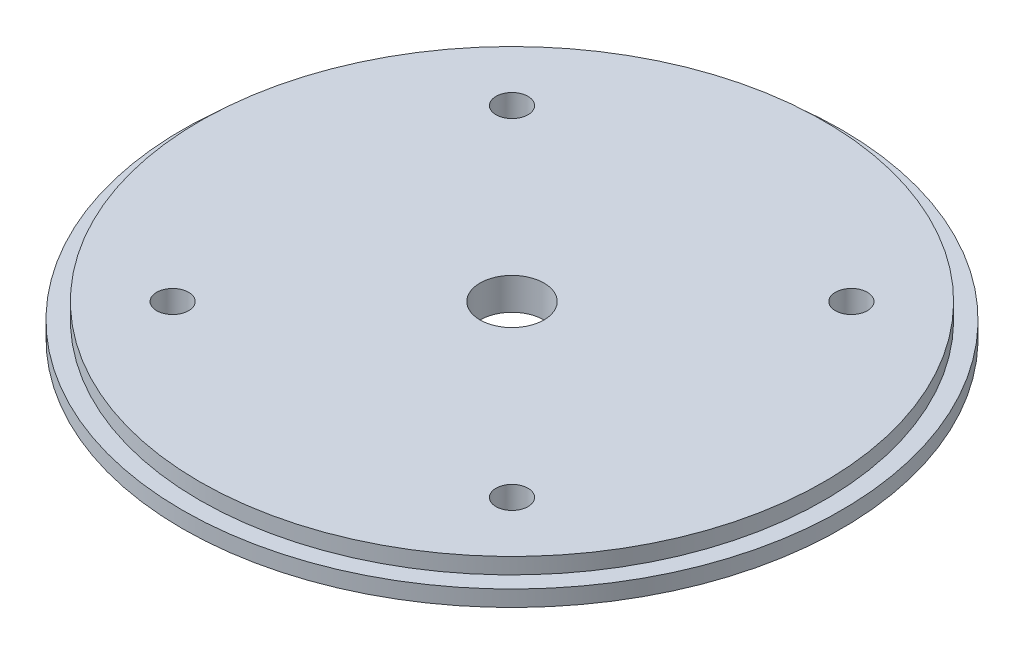
ISO-10303-21;
HEADER;
FILE_DESCRIPTION(('STEP AP214'),'2;1');
FILE_NAME('part.step','',(''),(''),'','','');
FILE_SCHEMA(('AUTOMOTIVE_DESIGN { 1 0 10303 214 1 1 1 1 }'));
ENDSEC;
DATA;
#1=APPLICATION_CONTEXT('core data for automotive mechanical design processes');
#2=APPLICATION_PROTOCOL_DEFINITION('international standard','automotive_design',2000,#1);
#3=PRODUCT_CONTEXT('',#1,'mechanical');
#4=PRODUCT('Part','Part','',(#3));
#5=PRODUCT_RELATED_PRODUCT_CATEGORY('part','',(#4));
#6=PRODUCT_DEFINITION_FORMATION('','',#4);
#7=PRODUCT_DEFINITION_CONTEXT('part definition',#1,'design');
#8=PRODUCT_DEFINITION('design','',#6,#7);
#9=PRODUCT_DEFINITION_SHAPE('','',#8);
#10=(LENGTH_UNIT() NAMED_UNIT(*) SI_UNIT(.MILLI.,.METRE.));
#11=(NAMED_UNIT(*) PLANE_ANGLE_UNIT() SI_UNIT($,.RADIAN.));
#12=(NAMED_UNIT(*) SI_UNIT($,.STERADIAN.) SOLID_ANGLE_UNIT());
#13=UNCERTAINTY_MEASURE_WITH_UNIT(LENGTH_MEASURE(1.E-05),#10,'distance_accuracy_value','');
#14=(GEOMETRIC_REPRESENTATION_CONTEXT(3) GLOBAL_UNCERTAINTY_ASSIGNED_CONTEXT((#13)) GLOBAL_UNIT_ASSIGNED_CONTEXT((#10,
#11,#12)) REPRESENTATION_CONTEXT('',''));
#15=CARTESIAN_POINT('',(0.,0.,0.));
#16=DIRECTION('',(0.,0.,1.));
#17=DIRECTION('',(1.,0.,0.));
#18=AXIS2_PLACEMENT_3D('',#15,#16,#17);
#19=CARTESIAN_POINT('',(-33.6759604540092,6.35,-33.6759604540095));
#20=DIRECTION('',(0.,1.,0.));
#21=DIRECTION('',(0.,0.,1.));
#22=AXIS2_PLACEMENT_3D('',#19,#20,#21);
#23=CYLINDRICAL_SURFACE('',#22,3.175);
#24=CARTESIAN_POINT('',(-33.6759604540092,6.35,-33.6759604540095));
#25=DIRECTION('',(0.,1.,0.));
#26=DIRECTION('',(0.,0.,1.));
#27=AXIS2_PLACEMENT_3D('',#24,#25,#26);
#28=CIRCLE('',#27,3.175);
#29=CARTESIAN_POINT('',(-33.6759604540092,6.35,-30.5009604540095));
#30=VERTEX_POINT('',#29);
#31=EDGE_CURVE('E88',#30,#30,#28,.T.);
#32=ORIENTED_EDGE('',*,*,#31,.T.);
#33=EDGE_LOOP('',(#32));
#34=FACE_BOUND('',#33,.T.);
#35=CARTESIAN_POINT('',(-33.6759604540092,1.5875,-33.6759604540095));
#36=DIRECTION('',(0.,-1.,0.));
#37=DIRECTION('',(0.,0.,-1.));
#38=AXIS2_PLACEMENT_3D('',#35,#36,#37);
#39=CIRCLE('',#38,3.175);
#40=CARTESIAN_POINT('',(-33.6759604540092,1.5875,-36.8509604540095));
#41=VERTEX_POINT('',#40);
#42=EDGE_CURVE('E41',#41,#41,#39,.F.);
#43=ORIENTED_EDGE('',*,*,#42,.F.);
#44=EDGE_LOOP('',(#43));
#45=FACE_BOUND('',#44,.T.);
#46=ADVANCED_FACE('F37',(#34,#45),#23,.F.);
#47=CARTESIAN_POINT('',(33.6759604540091,6.35,33.6759604540095));
#48=DIRECTION('',(0.,1.,0.));
#49=DIRECTION('',(0.,0.,1.));
#50=AXIS2_PLACEMENT_3D('',#47,#48,#49);
#51=CYLINDRICAL_SURFACE('',#50,3.175);
#52=CARTESIAN_POINT('',(33.6759604540091,6.35,33.6759604540095));
#53=DIRECTION('',(0.,1.,0.));
#54=DIRECTION('',(0.,0.,1.));
#55=AXIS2_PLACEMENT_3D('',#52,#53,#54);
#56=CIRCLE('',#55,3.175);
#57=CARTESIAN_POINT('',(33.6759604540091,6.35,36.8509604540095));
#58=VERTEX_POINT('',#57);
#59=EDGE_CURVE('E85',#58,#58,#56,.T.);
#60=ORIENTED_EDGE('',*,*,#59,.T.);
#61=EDGE_LOOP('',(#60));
#62=FACE_BOUND('',#61,.T.);
#63=CARTESIAN_POINT('',(33.6759604540091,1.5875,33.6759604540095));
#64=DIRECTION('',(0.,-1.,0.));
#65=DIRECTION('',(0.,0.,-1.));
#66=AXIS2_PLACEMENT_3D('',#63,#64,#65);
#67=CIRCLE('',#66,3.175);
#68=CARTESIAN_POINT('',(33.6759604540091,1.5875,30.5009604540095));
#69=VERTEX_POINT('',#68);
#70=EDGE_CURVE('E60',#69,#69,#67,.F.);
#71=ORIENTED_EDGE('',*,*,#70,.F.);
#72=EDGE_LOOP('',(#71));
#73=FACE_BOUND('',#72,.T.);
#74=ADVANCED_FACE('F115',(#62,#73),#51,.F.);
#75=CARTESIAN_POINT('',(33.6759604540095,6.35,-33.6759604540092));
#76=DIRECTION('',(0.,1.,0.));
#77=DIRECTION('',(0.,0.,1.));
#78=AXIS2_PLACEMENT_3D('',#75,#76,#77);
#79=CYLINDRICAL_SURFACE('',#78,3.175);
#80=CARTESIAN_POINT('',(33.6759604540095,6.35,-33.6759604540092));
#81=DIRECTION('',(0.,1.,0.));
#82=DIRECTION('',(0.,0.,1.));
#83=AXIS2_PLACEMENT_3D('',#80,#81,#82);
#84=CIRCLE('',#83,3.175);
#85=CARTESIAN_POINT('',(33.6759604540095,6.35,-30.5009604540092));
#86=VERTEX_POINT('',#85);
#87=EDGE_CURVE('E82',#86,#86,#84,.T.);
#88=ORIENTED_EDGE('',*,*,#87,.T.);
#89=EDGE_LOOP('',(#88));
#90=FACE_BOUND('',#89,.T.);
#91=CARTESIAN_POINT('',(33.6759604540095,1.5875,-33.6759604540092));
#92=DIRECTION('',(0.,-1.,0.));
#93=DIRECTION('',(0.,0.,-1.));
#94=AXIS2_PLACEMENT_3D('',#91,#92,#93);
#95=CIRCLE('',#94,3.175);
#96=CARTESIAN_POINT('',(33.6759604540095,1.5875,-36.8509604540092));
#97=VERTEX_POINT('',#96);
#98=EDGE_CURVE('E57',#97,#97,#95,.F.);
#99=ORIENTED_EDGE('',*,*,#98,.F.);
#100=EDGE_LOOP('',(#99));
#101=FACE_BOUND('',#100,.T.);
#102=ADVANCED_FACE('F121',(#90,#101),#79,.F.);
#103=CARTESIAN_POINT('',(-33.6759604540095,6.35,33.6759604540092));
#104=DIRECTION('',(0.,1.,0.));
#105=DIRECTION('',(0.,0.,1.));
#106=AXIS2_PLACEMENT_3D('',#103,#104,#105);
#107=CYLINDRICAL_SURFACE('',#106,3.175);
#108=CARTESIAN_POINT('',(-33.6759604540095,6.35,33.6759604540092));
#109=DIRECTION('',(0.,1.,0.));
#110=DIRECTION('',(0.,0.,1.));
#111=AXIS2_PLACEMENT_3D('',#108,#109,#110);
#112=CIRCLE('',#111,3.175);
#113=CARTESIAN_POINT('',(-33.6759604540095,6.35,36.8509604540092));
#114=VERTEX_POINT('',#113);
#115=EDGE_CURVE('E74',#114,#114,#112,.T.);
#116=ORIENTED_EDGE('',*,*,#115,.T.);
#117=EDGE_LOOP('',(#116));
#118=FACE_BOUND('',#117,.T.);
#119=CARTESIAN_POINT('',(-33.6759604540095,1.5875,33.6759604540092));
#120=DIRECTION('',(0.,-1.,0.));
#121=DIRECTION('',(0.,0.,-1.));
#122=AXIS2_PLACEMENT_3D('',#119,#120,#121);
#123=CIRCLE('',#122,3.175);
#124=CARTESIAN_POINT('',(-33.6759604540095,1.5875,30.5009604540092));
#125=VERTEX_POINT('',#124);
#126=EDGE_CURVE('E54',#125,#125,#123,.F.);
#127=ORIENTED_EDGE('',*,*,#126,.F.);
#128=EDGE_LOOP('',(#127));
#129=FACE_BOUND('',#128,.T.);
#130=ADVANCED_FACE('F128',(#118,#129),#107,.F.);
#131=CARTESIAN_POINT('',(0.,6.35,0.));
#132=DIRECTION('',(0.,-1.,0.));
#133=DIRECTION('',(0.,0.,-1.));
#134=AXIS2_PLACEMENT_3D('',#131,#132,#133);
#135=CYLINDRICAL_SURFACE('',#134,65.405);
#136=CARTESIAN_POINT('',(0.,0.,0.));
#137=DIRECTION('',(0.,1.,0.));
#138=DIRECTION('',(0.,0.,1.));
#139=AXIS2_PLACEMENT_3D('',#136,#137,#138);
#140=CIRCLE('',#139,65.405);
#141=CARTESIAN_POINT('',(0.,0.,65.405));
#142=VERTEX_POINT('',#141);
#143=EDGE_CURVE('E10',#142,#142,#140,.T.);
#144=ORIENTED_EDGE('',*,*,#143,.T.);
#145=EDGE_LOOP('',(#144));
#146=FACE_BOUND('',#145,.T.);
#147=CARTESIAN_POINT('',(0.,3.175,0.));
#148=DIRECTION('',(0.,1.,0.));
#149=DIRECTION('',(0.,0.,1.));
#150=AXIS2_PLACEMENT_3D('',#147,#148,#149);
#151=CIRCLE('',#150,65.405);
#152=CARTESIAN_POINT('',(0.,3.175,65.405));
#153=VERTEX_POINT('',#152);
#154=EDGE_CURVE('E45',#153,#153,#151,.T.);
#155=ORIENTED_EDGE('',*,*,#154,.F.);
#156=EDGE_LOOP('',(#155));
#157=FACE_BOUND('',#156,.T.);
#158=ADVANCED_FACE('F39',(#146,#157),#135,.T.);
#159=CARTESIAN_POINT('',(0.,0.,0.));
#160=DIRECTION('',(0.,1.,0.));
#161=DIRECTION('',(0.,0.,1.));
#162=AXIS2_PLACEMENT_3D('',#159,#160,#161);
#163=PLANE('',#162);
#164=CARTESIAN_POINT('',(-33.6759604540092,0.,-33.6759604540095));
#165=DIRECTION('',(0.,-1.,0.));
#166=DIRECTION('',(0.,0.,-1.));
#167=AXIS2_PLACEMENT_3D('',#164,#165,#166);
#168=CIRCLE('',#167,6.0325);
#169=CARTESIAN_POINT('',(-33.6759604540092,0.,-39.7084604540095));
#170=VERTEX_POINT('',#169);
#171=EDGE_CURVE('E186',#170,#170,#168,.T.);
#172=ORIENTED_EDGE('',*,*,#171,.F.);
#173=EDGE_LOOP('',(#172));
#174=FACE_BOUND('',#173,.T.);
#175=CARTESIAN_POINT('',(33.6759604540095,0.,-33.6759604540092));
#176=DIRECTION('',(0.,-1.,0.));
#177=DIRECTION('',(0.,0.,-1.));
#178=AXIS2_PLACEMENT_3D('',#175,#176,#177);
#179=CIRCLE('',#178,6.0325);
#180=CARTESIAN_POINT('',(33.6759604540095,0.,-39.7084604540092));
#181=VERTEX_POINT('',#180);
#182=EDGE_CURVE('E178',#181,#181,#179,.T.);
#183=ORIENTED_EDGE('',*,*,#182,.F.);
#184=EDGE_LOOP('',(#183));
#185=FACE_BOUND('',#184,.T.);
#186=CARTESIAN_POINT('',(33.6759604540091,0.,33.6759604540095));
#187=DIRECTION('',(0.,-1.,0.));
#188=DIRECTION('',(0.,0.,-1.));
#189=AXIS2_PLACEMENT_3D('',#186,#187,#188);
#190=CIRCLE('',#189,6.03249999999999);
#191=CARTESIAN_POINT('',(33.6759604540091,0.,27.6434604540095));
#192=VERTEX_POINT('',#191);
#193=EDGE_CURVE('E174',#192,#192,#190,.T.);
#194=ORIENTED_EDGE('',*,*,#193,.F.);
#195=EDGE_LOOP('',(#194));
#196=FACE_BOUND('',#195,.T.);
#197=CARTESIAN_POINT('',(-33.6759604540095,0.,33.6759604540092));
#198=DIRECTION('',(0.,-1.,0.));
#199=DIRECTION('',(0.,0.,-1.));
#200=AXIS2_PLACEMENT_3D('',#197,#198,#199);
#201=CIRCLE('',#200,6.0325);
#202=CARTESIAN_POINT('',(-33.6759604540095,0.,27.6434604540092));
#203=VERTEX_POINT('',#202);
#204=EDGE_CURVE('E77',#203,#203,#201,.T.);
#205=ORIENTED_EDGE('',*,*,#204,.F.);
#206=EDGE_LOOP('',(#205));
#207=FACE_BOUND('',#206,.T.);
#208=CARTESIAN_POINT('',(0.,0.,0.));
#209=DIRECTION('',(0.,1.,0.));
#210=DIRECTION('',(0.,0.,1.));
#211=AXIS2_PLACEMENT_3D('',#208,#209,#210);
#212=CIRCLE('',#211,6.35);
#213=CARTESIAN_POINT('',(0.,0.,6.35));
#214=VERTEX_POINT('',#213);
#215=EDGE_CURVE('E69',#214,#214,#212,.T.);
#216=ORIENTED_EDGE('',*,*,#215,.T.);
#217=EDGE_LOOP('',(#216));
#218=FACE_BOUND('',#217,.T.);
#219=ORIENTED_EDGE('',*,*,#143,.F.);
#220=EDGE_LOOP('',(#219));
#221=FACE_BOUND('',#220,.T.);
#222=ADVANCED_FACE('F110',(#174,#185,#196,#207,#218,#221),#163,.F.);
#223=CARTESIAN_POINT('',(0.,3.175,0.));
#224=DIRECTION('',(0.,1.,0.));
#225=DIRECTION('',(0.,0.,1.));
#226=AXIS2_PLACEMENT_3D('',#223,#224,#225);
#227=PLANE('',#226);
#228=CARTESIAN_POINT('',(0.,3.175,0.));
#229=DIRECTION('',(0.,1.,0.));
#230=DIRECTION('',(0.,0.,1.));
#231=AXIS2_PLACEMENT_3D('',#228,#229,#230);
#232=CIRCLE('',#231,61.976);
#233=CARTESIAN_POINT('',(0.,3.175,61.976));
#234=VERTEX_POINT('',#233);
#235=EDGE_CURVE('E50',#234,#234,#232,.T.);
#236=ORIENTED_EDGE('',*,*,#235,.F.);
#237=EDGE_LOOP('',(#236));
#238=FACE_BOUND('',#237,.T.);
#239=ORIENTED_EDGE('',*,*,#154,.T.);
#240=EDGE_LOOP('',(#239));
#241=FACE_BOUND('',#240,.T.);
#242=ADVANCED_FACE('F100',(#238,#241),#227,.T.);
#243=CARTESIAN_POINT('',(0.,3.175,0.));
#244=DIRECTION('',(0.,1.,0.));
#245=DIRECTION('',(0.,0.,1.));
#246=AXIS2_PLACEMENT_3D('',#243,#244,#245);
#247=CYLINDRICAL_SURFACE('',#246,61.976);
#248=ORIENTED_EDGE('',*,*,#235,.T.);
#249=EDGE_LOOP('',(#248));
#250=FACE_BOUND('',#249,.T.);
#251=CARTESIAN_POINT('',(0.,6.35,0.));
#252=DIRECTION('',(0.,1.,0.));
#253=DIRECTION('',(0.,0.,1.));
#254=AXIS2_PLACEMENT_3D('',#251,#252,#253);
#255=CIRCLE('',#254,61.976);
#256=CARTESIAN_POINT('',(0.,6.35,61.976));
#257=VERTEX_POINT('',#256);
#258=EDGE_CURVE('E91',#257,#257,#255,.T.);
#259=ORIENTED_EDGE('',*,*,#258,.F.);
#260=EDGE_LOOP('',(#259));
#261=FACE_BOUND('',#260,.T.);
#262=ADVANCED_FACE('F98',(#250,#261),#247,.T.);
#263=CARTESIAN_POINT('',(0.,6.35,0.));
#264=DIRECTION('',(0.,1.,0.));
#265=DIRECTION('',(0.,0.,1.));
#266=AXIS2_PLACEMENT_3D('',#263,#264,#265);
#267=PLANE('',#266);
#268=CARTESIAN_POINT('',(0.,6.35,0.));
#269=DIRECTION('',(0.,1.,0.));
#270=DIRECTION('',(0.,0.,1.));
#271=AXIS2_PLACEMENT_3D('',#268,#269,#270);
#272=CIRCLE('',#271,6.35);
#273=CARTESIAN_POINT('',(0.,6.35,6.35));
#274=VERTEX_POINT('',#273);
#275=EDGE_CURVE('E65',#274,#274,#272,.T.);
#276=ORIENTED_EDGE('',*,*,#275,.F.);
#277=EDGE_LOOP('',(#276));
#278=FACE_BOUND('',#277,.T.);
#279=ORIENTED_EDGE('',*,*,#115,.F.);
#280=EDGE_LOOP('',(#279));
#281=FACE_BOUND('',#280,.T.);
#282=ORIENTED_EDGE('',*,*,#87,.F.);
#283=EDGE_LOOP('',(#282));
#284=FACE_BOUND('',#283,.T.);
#285=ORIENTED_EDGE('',*,*,#59,.F.);
#286=EDGE_LOOP('',(#285));
#287=FACE_BOUND('',#286,.T.);
#288=ORIENTED_EDGE('',*,*,#31,.F.);
#289=EDGE_LOOP('',(#288));
#290=FACE_BOUND('',#289,.T.);
#291=ORIENTED_EDGE('',*,*,#258,.T.);
#292=EDGE_LOOP('',(#291));
#293=FACE_BOUND('',#292,.T.);
#294=ADVANCED_FACE('F96',(#278,#281,#284,#287,#290,#293),#267,.T.);
#295=CARTESIAN_POINT('',(0.,6.35,0.));
#296=DIRECTION('',(0.,1.,0.));
#297=DIRECTION('',(0.,0.,1.));
#298=AXIS2_PLACEMENT_3D('',#295,#296,#297);
#299=CYLINDRICAL_SURFACE('',#298,6.35);
#300=ORIENTED_EDGE('',*,*,#215,.F.);
#301=EDGE_LOOP('',(#300));
#302=FACE_BOUND('',#301,.T.);
#303=ORIENTED_EDGE('',*,*,#275,.T.);
#304=EDGE_LOOP('',(#303));
#305=FACE_BOUND('',#304,.T.);
#306=ADVANCED_FACE('F107',(#302,#305),#299,.F.);
#307=CARTESIAN_POINT('',(-33.6759604540095,1.5875,33.6759604540092));
#308=DIRECTION('',(0.,-1.,0.));
#309=DIRECTION('',(0.,0.,-1.));
#310=AXIS2_PLACEMENT_3D('',#307,#308,#309);
#311=PLANE('',#310);
#312=CARTESIAN_POINT('',(-33.6759604540095,1.5875,33.6759604540092));
#313=DIRECTION('',(0.,-1.,0.));
#314=DIRECTION('',(0.,0.,-1.));
#315=AXIS2_PLACEMENT_3D('',#312,#313,#314);
#316=CIRCLE('',#315,6.0325);
#317=CARTESIAN_POINT('',(-33.6759604540095,1.5875,27.6434604540092));
#318=VERTEX_POINT('',#317);
#319=EDGE_CURVE('E58',#318,#318,#316,.T.);
#320=ORIENTED_EDGE('',*,*,#319,.T.);
#321=EDGE_LOOP('',(#320));
#322=FACE_BOUND('',#321,.T.);
#323=ORIENTED_EDGE('',*,*,#126,.T.);
#324=EDGE_LOOP('',(#323));
#325=FACE_BOUND('',#324,.T.);
#326=ADVANCED_FACE('F134',(#322,#325),#311,.T.);
#327=CARTESIAN_POINT('',(-33.6759604540095,1.5875,33.6759604540092));
#328=DIRECTION('',(0.,-1.,0.));
#329=DIRECTION('',(0.,0.,-1.));
#330=AXIS2_PLACEMENT_3D('',#327,#328,#329);
#331=CYLINDRICAL_SURFACE('',#330,6.0325);
#332=ORIENTED_EDGE('',*,*,#319,.F.);
#333=EDGE_LOOP('',(#332));
#334=FACE_BOUND('',#333,.T.);
#335=ORIENTED_EDGE('',*,*,#204,.T.);
#336=EDGE_LOOP('',(#335));
#337=FACE_BOUND('',#336,.T.);
#338=ADVANCED_FACE('F136',(#334,#337),#331,.F.);
#339=CARTESIAN_POINT('',(33.6759604540095,1.5875,-33.6759604540092));
#340=DIRECTION('',(0.,-1.,0.));
#341=DIRECTION('',(0.,0.,-1.));
#342=AXIS2_PLACEMENT_3D('',#339,#340,#341);
#343=PLANE('',#342);
#344=CARTESIAN_POINT('',(33.6759604540095,1.5875,-33.6759604540092));
#345=DIRECTION('',(0.,-1.,0.));
#346=DIRECTION('',(0.,0.,-1.));
#347=AXIS2_PLACEMENT_3D('',#344,#345,#346);
#348=CIRCLE('',#347,6.0325);
#349=CARTESIAN_POINT('',(33.6759604540095,1.5875,-39.7084604540092));
#350=VERTEX_POINT('',#349);
#351=EDGE_CURVE('E183',#350,#350,#348,.T.);
#352=ORIENTED_EDGE('',*,*,#351,.T.);
#353=EDGE_LOOP('',(#352));
#354=FACE_BOUND('',#353,.T.);
#355=ORIENTED_EDGE('',*,*,#98,.T.);
#356=EDGE_LOOP('',(#355));
#357=FACE_BOUND('',#356,.T.);
#358=ADVANCED_FACE('F139',(#354,#357),#343,.T.);
#359=CARTESIAN_POINT('',(33.6759604540095,1.5875,-33.6759604540092));
#360=DIRECTION('',(0.,-1.,0.));
#361=DIRECTION('',(0.,0.,-1.));
#362=AXIS2_PLACEMENT_3D('',#359,#360,#361);
#363=CYLINDRICAL_SURFACE('',#362,6.0325);
#364=ORIENTED_EDGE('',*,*,#351,.F.);
#365=EDGE_LOOP('',(#364));
#366=FACE_BOUND('',#365,.T.);
#367=ORIENTED_EDGE('',*,*,#182,.T.);
#368=EDGE_LOOP('',(#367));
#369=FACE_BOUND('',#368,.T.);
#370=ADVANCED_FACE('F155',(#366,#369),#363,.F.);
#371=CARTESIAN_POINT('',(33.6759604540091,1.5875,33.6759604540095));
#372=DIRECTION('',(0.,-1.,0.));
#373=DIRECTION('',(0.,0.,-1.));
#374=AXIS2_PLACEMENT_3D('',#371,#372,#373);
#375=PLANE('',#374);
#376=CARTESIAN_POINT('',(33.6759604540091,1.5875,33.6759604540095));
#377=DIRECTION('',(0.,-1.,0.));
#378=DIRECTION('',(0.,0.,-1.));
#379=AXIS2_PLACEMENT_3D('',#376,#377,#378);
#380=CIRCLE('',#379,6.03249999999999);
#381=CARTESIAN_POINT('',(33.6759604540091,1.5875,27.6434604540095));
#382=VERTEX_POINT('',#381);
#383=EDGE_CURVE('E171',#382,#382,#380,.T.);
#384=ORIENTED_EDGE('',*,*,#383,.T.);
#385=EDGE_LOOP('',(#384));
#386=FACE_BOUND('',#385,.T.);
#387=ORIENTED_EDGE('',*,*,#70,.T.);
#388=EDGE_LOOP('',(#387));
#389=FACE_BOUND('',#388,.T.);
#390=ADVANCED_FACE('F159',(#386,#389),#375,.T.);
#391=CARTESIAN_POINT('',(33.6759604540091,1.5875,33.6759604540095));
#392=DIRECTION('',(0.,-1.,0.));
#393=DIRECTION('',(0.,0.,-1.));
#394=AXIS2_PLACEMENT_3D('',#391,#392,#393);
#395=CYLINDRICAL_SURFACE('',#394,6.03249999999999);
#396=ORIENTED_EDGE('',*,*,#383,.F.);
#397=EDGE_LOOP('',(#396));
#398=FACE_BOUND('',#397,.T.);
#399=ORIENTED_EDGE('',*,*,#193,.T.);
#400=EDGE_LOOP('',(#399));
#401=FACE_BOUND('',#400,.T.);
#402=ADVANCED_FACE('F148',(#398,#401),#395,.F.);
#403=CARTESIAN_POINT('',(-33.6759604540092,1.5875,-33.6759604540095));
#404=DIRECTION('',(0.,-1.,0.));
#405=DIRECTION('',(0.,0.,-1.));
#406=AXIS2_PLACEMENT_3D('',#403,#404,#405);
#407=PLANE('',#406);
#408=CARTESIAN_POINT('',(-33.6759604540092,1.5875,-33.6759604540095));
#409=DIRECTION('',(0.,-1.,0.));
#410=DIRECTION('',(0.,0.,-1.));
#411=AXIS2_PLACEMENT_3D('',#408,#409,#410);
#412=CIRCLE('',#411,6.0325);
#413=CARTESIAN_POINT('',(-33.6759604540092,1.5875,-39.7084604540095));
#414=VERTEX_POINT('',#413);
#415=EDGE_CURVE('E189',#414,#414,#412,.T.);
#416=ORIENTED_EDGE('',*,*,#415,.T.);
#417=EDGE_LOOP('',(#416));
#418=FACE_BOUND('',#417,.T.);
#419=ORIENTED_EDGE('',*,*,#42,.T.);
#420=EDGE_LOOP('',(#419));
#421=FACE_BOUND('',#420,.T.);
#422=ADVANCED_FACE('F144',(#418,#421),#407,.T.);
#423=CARTESIAN_POINT('',(-33.6759604540092,1.5875,-33.6759604540095));
#424=DIRECTION('',(0.,-1.,0.));
#425=DIRECTION('',(0.,0.,-1.));
#426=AXIS2_PLACEMENT_3D('',#423,#424,#425);
#427=CYLINDRICAL_SURFACE('',#426,6.0325);
#428=ORIENTED_EDGE('',*,*,#415,.F.);
#429=EDGE_LOOP('',(#428));
#430=FACE_BOUND('',#429,.T.);
#431=ORIENTED_EDGE('',*,*,#171,.T.);
#432=EDGE_LOOP('',(#431));
#433=FACE_BOUND('',#432,.T.);
#434=ADVANCED_FACE('F147',(#430,#433),#427,.F.);
#435=CLOSED_SHELL('',(#46,#74,#102,#130,#158,#222,#242,#262,#294,#306,#326,#338,#358,#370,#390,
#402,#422,#434));
#436=MANIFOLD_SOLID_BREP('B2',#435);
#437=ADVANCED_BREP_SHAPE_REPRESENTATION('',(#18,#436),#14);
#438=SHAPE_DEFINITION_REPRESENTATION(#9,#437);
ENDSEC;
END-ISO-10303-21;
